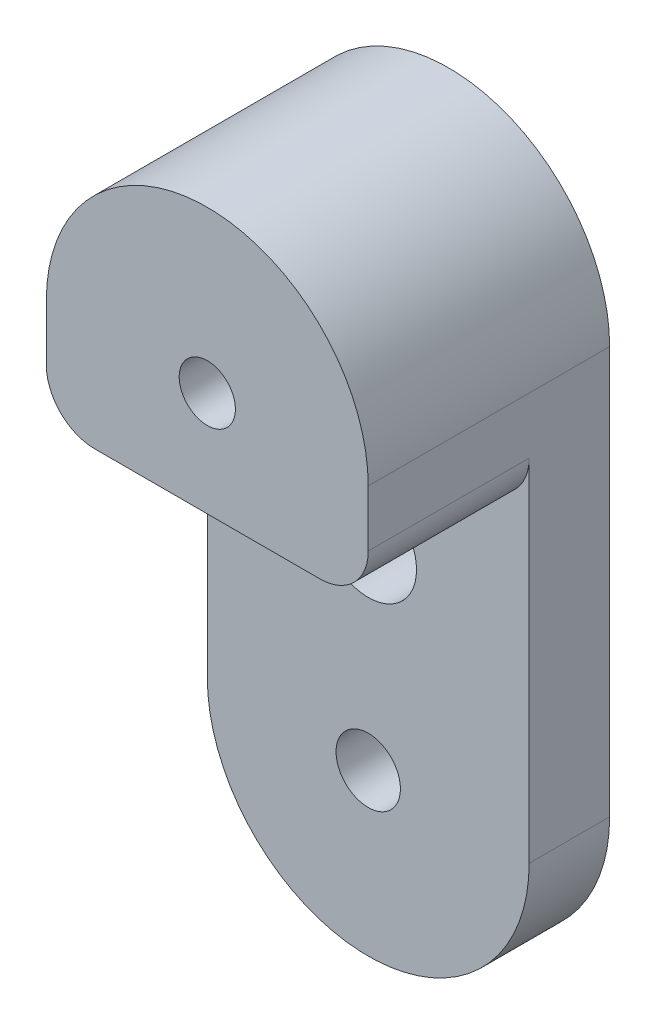
ISO-10303-21;
HEADER;
FILE_DESCRIPTION(('STEP AP214'),'2;1');
FILE_NAME('part.step','',(''),(''),'','','');
FILE_SCHEMA(('AUTOMOTIVE_DESIGN { 1 0 10303 214 1 1 1 1 }'));
ENDSEC;
DATA;
#1=APPLICATION_CONTEXT('core data for automotive mechanical design processes');
#2=APPLICATION_PROTOCOL_DEFINITION('international standard','automotive_design',2000,#1);
#3=PRODUCT_CONTEXT('',#1,'mechanical');
#4=PRODUCT('Part','Part','',(#3));
#5=PRODUCT_RELATED_PRODUCT_CATEGORY('part','',(#4));
#6=PRODUCT_DEFINITION_FORMATION('','',#4);
#7=PRODUCT_DEFINITION_CONTEXT('part definition',#1,'design');
#8=PRODUCT_DEFINITION('design','',#6,#7);
#9=PRODUCT_DEFINITION_SHAPE('','',#8);
#10=(LENGTH_UNIT() NAMED_UNIT(*) SI_UNIT(.MILLI.,.METRE.));
#11=(NAMED_UNIT(*) PLANE_ANGLE_UNIT() SI_UNIT($,.RADIAN.));
#12=(NAMED_UNIT(*) SI_UNIT($,.STERADIAN.) SOLID_ANGLE_UNIT());
#13=UNCERTAINTY_MEASURE_WITH_UNIT(LENGTH_MEASURE(1.E-05),#10,'distance_accuracy_value','');
#14=(GEOMETRIC_REPRESENTATION_CONTEXT(3) GLOBAL_UNCERTAINTY_ASSIGNED_CONTEXT((#13)) GLOBAL_UNIT_ASSIGNED_CONTEXT((#10,
#11,#12)) REPRESENTATION_CONTEXT('',''));
#15=CARTESIAN_POINT('',(0.,0.,0.));
#16=DIRECTION('',(0.,0.,1.));
#17=DIRECTION('',(1.,0.,0.));
#18=AXIS2_PLACEMENT_3D('',#15,#16,#17);
#19=CARTESIAN_POINT('',(-10.,0.,5.));
#20=DIRECTION('',(1.,0.,0.));
#21=DIRECTION('',(0.,1.,0.));
#22=AXIS2_PLACEMENT_3D('',#19,#20,#21);
#23=PLANE('',#22);
#24=DIRECTION('',(0.,-1.,0.));
#25=VECTOR('',#24,1.);
#26=CARTESIAN_POINT('',(-10.,0.,5.));
#27=LINE('',#26,#25);
#28=CARTESIAN_POINT('',(-10.,-3.5,5.));
#29=VERTEX_POINT('',#28);
#30=CARTESIAN_POINT('',(-10.,-25.3,5.));
#31=VERTEX_POINT('',#30);
#32=EDGE_CURVE('E50',#29,#31,#27,.T.);
#33=ORIENTED_EDGE('',*,*,#32,.F.);
#34=DIRECTION('',(0.,0.,-1.));
#35=VECTOR('',#34,1.);
#36=CARTESIAN_POINT('',(-10.,-3.5,5.));
#37=LINE('',#36,#35);
#38=CARTESIAN_POINT('',(-10.,-3.5,15.));
#39=VERTEX_POINT('',#38);
#40=EDGE_CURVE('E54',#29,#39,#37,.F.);
#41=ORIENTED_EDGE('',*,*,#40,.T.);
#42=DIRECTION('',(0.,-1.,0.));
#43=VECTOR('',#42,1.);
#44=CARTESIAN_POINT('',(-10.,0.,15.));
#45=LINE('',#44,#43);
#46=CARTESIAN_POINT('',(-10.,0.,15.));
#47=VERTEX_POINT('',#46);
#48=EDGE_CURVE('E129',#47,#39,#45,.T.);
#49=ORIENTED_EDGE('',*,*,#48,.F.);
#50=DIRECTION('',(0.,0.,-1.));
#51=VECTOR('',#50,1.);
#52=CARTESIAN_POINT('',(-10.,0.,15.));
#53=LINE('',#52,#51);
#54=CARTESIAN_POINT('',(-10.,0.,0.));
#55=VERTEX_POINT('',#54);
#56=EDGE_CURVE('E113',#47,#55,#53,.T.);
#57=ORIENTED_EDGE('',*,*,#56,.T.);
#58=DIRECTION('',(0.,-1.,0.));
#59=VECTOR('',#58,1.);
#60=CARTESIAN_POINT('',(-10.,0.,0.));
#61=LINE('',#60,#59);
#62=CARTESIAN_POINT('',(-10.,-25.3,0.));
#63=VERTEX_POINT('',#62);
#64=EDGE_CURVE('E162',#55,#63,#61,.T.);
#65=ORIENTED_EDGE('',*,*,#64,.T.);
#66=DIRECTION('',(0.,0.,-1.));
#67=VECTOR('',#66,1.);
#68=CARTESIAN_POINT('',(-10.,-25.3,5.));
#69=LINE('',#68,#67);
#70=EDGE_CURVE('E170',#31,#63,#69,.T.);
#71=ORIENTED_EDGE('',*,*,#70,.F.);
#72=EDGE_LOOP('',(#33,#41,#49,#57,#65,#71));
#73=FACE_BOUND('',#72,.T.);
#74=ADVANCED_FACE('F35',(#73),#23,.F.);
#75=CARTESIAN_POINT('',(0.,-25.3,5.));
#76=DIRECTION('',(0.,0.,-1.));
#77=DIRECTION('',(-1.,0.,0.));
#78=AXIS2_PLACEMENT_3D('',#75,#76,#77);
#79=CYLINDRICAL_SURFACE('',#78,10.);
#80=CARTESIAN_POINT('',(0.,-25.3,0.));
#81=DIRECTION('',(0.,0.,1.));
#82=DIRECTION('',(1.,0.,0.));
#83=AXIS2_PLACEMENT_3D('',#80,#81,#82);
#84=CIRCLE('',#83,10.);
#85=CARTESIAN_POINT('',(10.,-25.3,0.));
#86=VERTEX_POINT('',#85);
#87=EDGE_CURVE('E165',#63,#86,#84,.T.);
#88=ORIENTED_EDGE('',*,*,#87,.T.);
#89=DIRECTION('',(0.,0.,-1.));
#90=VECTOR('',#89,1.);
#91=CARTESIAN_POINT('',(10.,-25.3,5.));
#92=LINE('',#91,#90);
#93=CARTESIAN_POINT('',(10.,-25.3,5.));
#94=VERTEX_POINT('',#93);
#95=EDGE_CURVE('E156',#94,#86,#92,.T.);
#96=ORIENTED_EDGE('',*,*,#95,.F.);
#97=CARTESIAN_POINT('',(0.,-25.3,5.));
#98=DIRECTION('',(0.,0.,1.));
#99=DIRECTION('',(1.,0.,0.));
#100=AXIS2_PLACEMENT_3D('',#97,#98,#99);
#101=CIRCLE('',#100,10.);
#102=EDGE_CURVE('E148',#31,#94,#101,.T.);
#103=ORIENTED_EDGE('',*,*,#102,.F.);
#104=ORIENTED_EDGE('',*,*,#70,.T.);
#105=EDGE_LOOP('',(#88,#96,#103,#104));
#106=FACE_BOUND('',#105,.T.);
#107=ADVANCED_FACE('F196',(#106),#79,.T.);
#108=CARTESIAN_POINT('',(10.,0.,5.));
#109=DIRECTION('',(1.,0.,0.));
#110=DIRECTION('',(0.,1.,0.));
#111=AXIS2_PLACEMENT_3D('',#108,#109,#110);
#112=PLANE('',#111);
#113=DIRECTION('',(0.,-1.,0.));
#114=VECTOR('',#113,1.);
#115=CARTESIAN_POINT('',(10.,0.,15.));
#116=LINE('',#115,#114);
#117=CARTESIAN_POINT('',(10.,0.,15.));
#118=VERTEX_POINT('',#117);
#119=CARTESIAN_POINT('',(10.,-3.5,15.));
#120=VERTEX_POINT('',#119);
#121=EDGE_CURVE('E105',#118,#120,#116,.T.);
#122=ORIENTED_EDGE('',*,*,#121,.T.);
#123=DIRECTION('',(0.,0.,-1.));
#124=VECTOR('',#123,1.);
#125=CARTESIAN_POINT('',(10.,-3.5,5.));
#126=LINE('',#125,#124);
#127=CARTESIAN_POINT('',(10.,-3.5,5.));
#128=VERTEX_POINT('',#127);
#129=EDGE_CURVE('E173',#120,#128,#126,.T.);
#130=ORIENTED_EDGE('',*,*,#129,.T.);
#131=DIRECTION('',(0.,-1.,0.));
#132=VECTOR('',#131,1.);
#133=CARTESIAN_POINT('',(10.,0.,5.));
#134=LINE('',#133,#132);
#135=EDGE_CURVE('E150',#128,#94,#134,.T.);
#136=ORIENTED_EDGE('',*,*,#135,.T.);
#137=ORIENTED_EDGE('',*,*,#95,.T.);
#138=DIRECTION('',(0.,-1.,0.));
#139=VECTOR('',#138,1.);
#140=CARTESIAN_POINT('',(10.,0.,0.));
#141=LINE('',#140,#139);
#142=CARTESIAN_POINT('',(10.,0.,0.));
#143=VERTEX_POINT('',#142);
#144=EDGE_CURVE('E108',#143,#86,#141,.T.);
#145=ORIENTED_EDGE('',*,*,#144,.F.);
#146=DIRECTION('',(0.,0.,-1.));
#147=VECTOR('',#146,1.);
#148=CARTESIAN_POINT('',(10.,0.,15.));
#149=LINE('',#148,#147);
#150=EDGE_CURVE('E100',#118,#143,#149,.T.);
#151=ORIENTED_EDGE('',*,*,#150,.F.);
#152=EDGE_LOOP('',(#122,#130,#136,#137,#145,#151));
#153=FACE_BOUND('',#152,.T.);
#154=ADVANCED_FACE('F102',(#153),#112,.T.);
#155=CARTESIAN_POINT('',(0.,-25.3,5.));
#156=DIRECTION('',(0.,0.,-1.));
#157=DIRECTION('',(-1.,0.,0.));
#158=AXIS2_PLACEMENT_3D('',#155,#156,#157);
#159=CYLINDRICAL_SURFACE('',#158,2.);
#160=CARTESIAN_POINT('',(0.,-25.3,5.));
#161=DIRECTION('',(0.,0.,1.));
#162=DIRECTION('',(1.,0.,0.));
#163=AXIS2_PLACEMENT_3D('',#160,#161,#162);
#164=CIRCLE('',#163,2.);
#165=CARTESIAN_POINT('',(2.,-25.3,5.));
#166=VERTEX_POINT('',#165);
#167=EDGE_CURVE('E144',#166,#166,#164,.T.);
#168=ORIENTED_EDGE('',*,*,#167,.T.);
#169=EDGE_LOOP('',(#168));
#170=FACE_BOUND('',#169,.T.);
#171=CARTESIAN_POINT('',(0.,-25.3,0.));
#172=DIRECTION('',(0.,0.,1.));
#173=DIRECTION('',(1.,0.,0.));
#174=AXIS2_PLACEMENT_3D('',#171,#172,#173);
#175=CIRCLE('',#174,2.);
#176=CARTESIAN_POINT('',(2.,-25.3,0.));
#177=VERTEX_POINT('',#176);
#178=EDGE_CURVE('E159',#177,#177,#175,.T.);
#179=ORIENTED_EDGE('',*,*,#178,.F.);
#180=EDGE_LOOP('',(#179));
#181=FACE_BOUND('',#180,.T.);
#182=ADVANCED_FACE('F214',(#170,#181),#159,.F.);
#183=CARTESIAN_POINT('',(0.,-13.,5.));
#184=DIRECTION('',(0.,0.,-1.));
#185=DIRECTION('',(-1.,0.,0.));
#186=AXIS2_PLACEMENT_3D('',#183,#184,#185);
#187=CYLINDRICAL_SURFACE('',#186,3.);
#188=CARTESIAN_POINT('',(0.,-13.,5.));
#189=DIRECTION('',(0.,0.,1.));
#190=DIRECTION('',(1.,0.,0.));
#191=AXIS2_PLACEMENT_3D('',#188,#189,#190);
#192=CIRCLE('',#191,3.);
#193=CARTESIAN_POINT('',(3.,-13.,5.));
#194=VERTEX_POINT('',#193);
#195=EDGE_CURVE('E141',#194,#194,#192,.T.);
#196=ORIENTED_EDGE('',*,*,#195,.T.);
#197=EDGE_LOOP('',(#196));
#198=FACE_BOUND('',#197,.T.);
#199=CARTESIAN_POINT('',(0.,-13.,0.));
#200=DIRECTION('',(0.,0.,1.));
#201=DIRECTION('',(1.,0.,0.));
#202=AXIS2_PLACEMENT_3D('',#199,#200,#201);
#203=CIRCLE('',#202,3.);
#204=CARTESIAN_POINT('',(3.,-13.,0.));
#205=VERTEX_POINT('',#204);
#206=EDGE_CURVE('E112',#205,#205,#203,.T.);
#207=ORIENTED_EDGE('',*,*,#206,.F.);
#208=EDGE_LOOP('',(#207));
#209=FACE_BOUND('',#208,.T.);
#210=ADVANCED_FACE('F217',(#198,#209),#187,.F.);
#211=CARTESIAN_POINT('',(0.,0.,5.));
#212=DIRECTION('',(0.,0.,1.));
#213=DIRECTION('',(1.,0.,0.));
#214=AXIS2_PLACEMENT_3D('',#211,#212,#213);
#215=PLANE('',#214);
#216=ORIENTED_EDGE('',*,*,#195,.F.);
#217=EDGE_LOOP('',(#216));
#218=FACE_BOUND('',#217,.T.);
#219=ORIENTED_EDGE('',*,*,#167,.F.);
#220=EDGE_LOOP('',(#219));
#221=FACE_BOUND('',#220,.T.);
#222=ORIENTED_EDGE('',*,*,#32,.T.);
#223=ORIENTED_EDGE('',*,*,#102,.T.);
#224=ORIENTED_EDGE('',*,*,#135,.F.);
#225=CARTESIAN_POINT('',(7.,-3.5,5.));
#226=DIRECTION('',(0.,0.,1.));
#227=DIRECTION('',(1.,0.,0.));
#228=AXIS2_PLACEMENT_3D('',#225,#226,#227);
#229=CIRCLE('',#228,3.);
#230=CARTESIAN_POINT('',(7.,-6.5,5.));
#231=VERTEX_POINT('',#230);
#232=EDGE_CURVE('E43',#128,#231,#229,.F.);
#233=ORIENTED_EDGE('',*,*,#232,.T.);
#234=DIRECTION('',(1.,0.,0.));
#235=VECTOR('',#234,1.);
#236=CARTESIAN_POINT('',(0.,-6.5,5.));
#237=LINE('',#236,#235);
#238=CARTESIAN_POINT('',(-7.,-6.5,5.));
#239=VERTEX_POINT('',#238);
#240=EDGE_CURVE('E153',#239,#231,#237,.T.);
#241=ORIENTED_EDGE('',*,*,#240,.F.);
#242=CARTESIAN_POINT('',(-7.,-3.5,5.));
#243=DIRECTION('',(0.,0.,1.));
#244=DIRECTION('',(1.,0.,0.));
#245=AXIS2_PLACEMENT_3D('',#242,#243,#244);
#246=CIRCLE('',#245,3.);
#247=EDGE_CURVE('E11',#239,#29,#246,.F.);
#248=ORIENTED_EDGE('',*,*,#247,.T.);
#249=EDGE_LOOP('',(#222,#223,#224,#233,#241,#248));
#250=FACE_BOUND('',#249,.T.);
#251=ADVANCED_FACE('F186',(#218,#221,#250),#215,.T.);
#252=CARTESIAN_POINT('',(0.,0.,0.));
#253=DIRECTION('',(0.,0.,1.));
#254=DIRECTION('',(1.,0.,0.));
#255=AXIS2_PLACEMENT_3D('',#252,#253,#254);
#256=PLANE('',#255);
#257=ORIENTED_EDGE('',*,*,#206,.T.);
#258=EDGE_LOOP('',(#257));
#259=FACE_BOUND('',#258,.T.);
#260=ORIENTED_EDGE('',*,*,#178,.T.);
#261=EDGE_LOOP('',(#260));
#262=FACE_BOUND('',#261,.T.);
#263=ORIENTED_EDGE('',*,*,#64,.F.);
#264=CARTESIAN_POINT('',(0.,0.,0.));
#265=DIRECTION('',(0.,0.,1.));
#266=DIRECTION('',(1.,0.,0.));
#267=AXIS2_PLACEMENT_3D('',#264,#265,#266);
#268=CIRCLE('',#267,10.);
#269=EDGE_CURVE('E135',#143,#55,#268,.T.);
#270=ORIENTED_EDGE('',*,*,#269,.F.);
#271=ORIENTED_EDGE('',*,*,#144,.T.);
#272=ORIENTED_EDGE('',*,*,#87,.F.);
#273=EDGE_LOOP('',(#263,#270,#271,#272));
#274=FACE_BOUND('',#273,.T.);
#275=CARTESIAN_POINT('',(0.,0.,0.));
#276=DIRECTION('',(0.,0.,1.));
#277=DIRECTION('',(1.,0.,0.));
#278=AXIS2_PLACEMENT_3D('',#275,#276,#277);
#279=CIRCLE('',#278,1.74625);
#280=CARTESIAN_POINT('',(1.74625,0.,0.));
#281=VERTEX_POINT('',#280);
#282=EDGE_CURVE('E137',#281,#281,#279,.T.);
#283=ORIENTED_EDGE('',*,*,#282,.T.);
#284=EDGE_LOOP('',(#283));
#285=FACE_BOUND('',#284,.T.);
#286=ADVANCED_FACE('F198',(#259,#262,#274,#285),#256,.F.);
#287=CARTESIAN_POINT('',(0.,-6.5,15.));
#288=DIRECTION('',(0.,1.,0.));
#289=DIRECTION('',(-1.,0.,0.));
#290=AXIS2_PLACEMENT_3D('',#287,#288,#289);
#291=PLANE('',#290);
#292=ORIENTED_EDGE('',*,*,#240,.T.);
#293=DIRECTION('',(0.,0.,-1.));
#294=VECTOR('',#293,1.);
#295=CARTESIAN_POINT('',(7.,-6.5,15.));
#296=LINE('',#295,#294);
#297=CARTESIAN_POINT('',(7.,-6.5,15.));
#298=VERTEX_POINT('',#297);
#299=EDGE_CURVE('E178',#231,#298,#296,.F.);
#300=ORIENTED_EDGE('',*,*,#299,.T.);
#301=DIRECTION('',(1.,0.,0.));
#302=VECTOR('',#301,1.);
#303=CARTESIAN_POINT('',(0.,-6.5,15.));
#304=LINE('',#303,#302);
#305=CARTESIAN_POINT('',(-7.,-6.5,15.));
#306=VERTEX_POINT('',#305);
#307=EDGE_CURVE('E127',#306,#298,#304,.T.);
#308=ORIENTED_EDGE('',*,*,#307,.F.);
#309=DIRECTION('',(0.,0.,-1.));
#310=VECTOR('',#309,1.);
#311=CARTESIAN_POINT('',(-7.,-6.5,15.));
#312=LINE('',#311,#310);
#313=EDGE_CURVE('E175',#306,#239,#312,.T.);
#314=ORIENTED_EDGE('',*,*,#313,.T.);
#315=EDGE_LOOP('',(#292,#300,#308,#314));
#316=FACE_BOUND('',#315,.T.);
#317=ADVANCED_FACE('F190',(#316),#291,.F.);
#318=CARTESIAN_POINT('',(0.,0.,15.));
#319=DIRECTION('',(0.,0.,-1.));
#320=DIRECTION('',(-1.,0.,0.));
#321=AXIS2_PLACEMENT_3D('',#318,#319,#320);
#322=CYLINDRICAL_SURFACE('',#321,10.);
#323=ORIENTED_EDGE('',*,*,#269,.T.);
#324=ORIENTED_EDGE('',*,*,#56,.F.);
#325=CARTESIAN_POINT('',(0.,0.,15.));
#326=DIRECTION('',(0.,0.,1.));
#327=DIRECTION('',(1.,0.,0.));
#328=AXIS2_PLACEMENT_3D('',#325,#326,#327);
#329=CIRCLE('',#328,10.);
#330=EDGE_CURVE('E116',#118,#47,#329,.T.);
#331=ORIENTED_EDGE('',*,*,#330,.F.);
#332=ORIENTED_EDGE('',*,*,#150,.T.);
#333=EDGE_LOOP('',(#323,#324,#331,#332));
#334=FACE_BOUND('',#333,.T.);
#335=ADVANCED_FACE('F117',(#334),#322,.T.);
#336=CARTESIAN_POINT('',(0.,0.,15.));
#337=DIRECTION('',(0.,0.,-1.));
#338=DIRECTION('',(-1.,0.,0.));
#339=AXIS2_PLACEMENT_3D('',#336,#337,#338);
#340=CYLINDRICAL_SURFACE('',#339,1.74625);
#341=CARTESIAN_POINT('',(0.,0.,15.));
#342=DIRECTION('',(0.,0.,1.));
#343=DIRECTION('',(1.,0.,0.));
#344=AXIS2_PLACEMENT_3D('',#341,#342,#343);
#345=CIRCLE('',#344,1.74625);
#346=CARTESIAN_POINT('',(1.74625,0.,15.));
#347=VERTEX_POINT('',#346);
#348=EDGE_CURVE('E120',#347,#347,#345,.T.);
#349=ORIENTED_EDGE('',*,*,#348,.T.);
#350=EDGE_LOOP('',(#349));
#351=FACE_BOUND('',#350,.T.);
#352=ORIENTED_EDGE('',*,*,#282,.F.);
#353=EDGE_LOOP('',(#352));
#354=FACE_BOUND('',#353,.T.);
#355=ADVANCED_FACE('F272',(#351,#354),#340,.F.);
#356=CARTESIAN_POINT('',(0.,0.,15.));
#357=DIRECTION('',(0.,0.,1.));
#358=DIRECTION('',(1.,0.,0.));
#359=AXIS2_PLACEMENT_3D('',#356,#357,#358);
#360=PLANE('',#359);
#361=ORIENTED_EDGE('',*,*,#307,.T.);
#362=CARTESIAN_POINT('',(7.,-3.5,15.));
#363=DIRECTION('',(0.,0.,1.));
#364=DIRECTION('',(1.,0.,0.));
#365=AXIS2_PLACEMENT_3D('',#362,#363,#364);
#366=CIRCLE('',#365,3.);
#367=EDGE_CURVE('E126',#298,#120,#366,.T.);
#368=ORIENTED_EDGE('',*,*,#367,.T.);
#369=ORIENTED_EDGE('',*,*,#121,.F.);
#370=ORIENTED_EDGE('',*,*,#330,.T.);
#371=ORIENTED_EDGE('',*,*,#48,.T.);
#372=CARTESIAN_POINT('',(-7.,-3.5,15.));
#373=DIRECTION('',(0.,0.,1.));
#374=DIRECTION('',(1.,0.,0.));
#375=AXIS2_PLACEMENT_3D('',#372,#373,#374);
#376=CIRCLE('',#375,3.);
#377=EDGE_CURVE('E180',#39,#306,#376,.T.);
#378=ORIENTED_EDGE('',*,*,#377,.T.);
#379=EDGE_LOOP('',(#361,#368,#369,#370,#371,#378));
#380=FACE_BOUND('',#379,.T.);
#381=ORIENTED_EDGE('',*,*,#348,.F.);
#382=EDGE_LOOP('',(#381));
#383=FACE_BOUND('',#382,.T.);
#384=ADVANCED_FACE('F123',(#380,#383),#360,.T.);
#385=CARTESIAN_POINT('',(7.,-3.5,5.));
#386=DIRECTION('',(0.,0.,1.));
#387=DIRECTION('',(1.,0.,0.));
#388=AXIS2_PLACEMENT_3D('',#385,#386,#387);
#389=CYLINDRICAL_SURFACE('',#388,3.);
#390=ORIENTED_EDGE('',*,*,#367,.F.);
#391=ORIENTED_EDGE('',*,*,#299,.F.);
#392=ORIENTED_EDGE('',*,*,#232,.F.);
#393=ORIENTED_EDGE('',*,*,#129,.F.);
#394=EDGE_LOOP('',(#390,#391,#392,#393));
#395=FACE_BOUND('',#394,.T.);
#396=ADVANCED_FACE('F193',(#395),#389,.T.);
#397=CARTESIAN_POINT('',(-7.,-3.5,15.));
#398=DIRECTION('',(0.,0.,-1.));
#399=DIRECTION('',(-1.,0.,0.));
#400=AXIS2_PLACEMENT_3D('',#397,#398,#399);
#401=CYLINDRICAL_SURFACE('',#400,3.);
#402=ORIENTED_EDGE('',*,*,#377,.F.);
#403=ORIENTED_EDGE('',*,*,#40,.F.);
#404=ORIENTED_EDGE('',*,*,#247,.F.);
#405=ORIENTED_EDGE('',*,*,#313,.F.);
#406=EDGE_LOOP('',(#402,#403,#404,#405));
#407=FACE_BOUND('',#406,.T.);
#408=ADVANCED_FACE('F37',(#407),#401,.T.);
#409=CLOSED_SHELL('',(#74,#107,#154,#182,#210,#251,#286,#317,#335,#355,#384,#396,#408));
#410=MANIFOLD_SOLID_BREP('B2',#409);
#411=ADVANCED_BREP_SHAPE_REPRESENTATION('',(#18,#410),#14);
#412=SHAPE_DEFINITION_REPRESENTATION(#9,#411);
ENDSEC;
END-ISO-10303-21;
